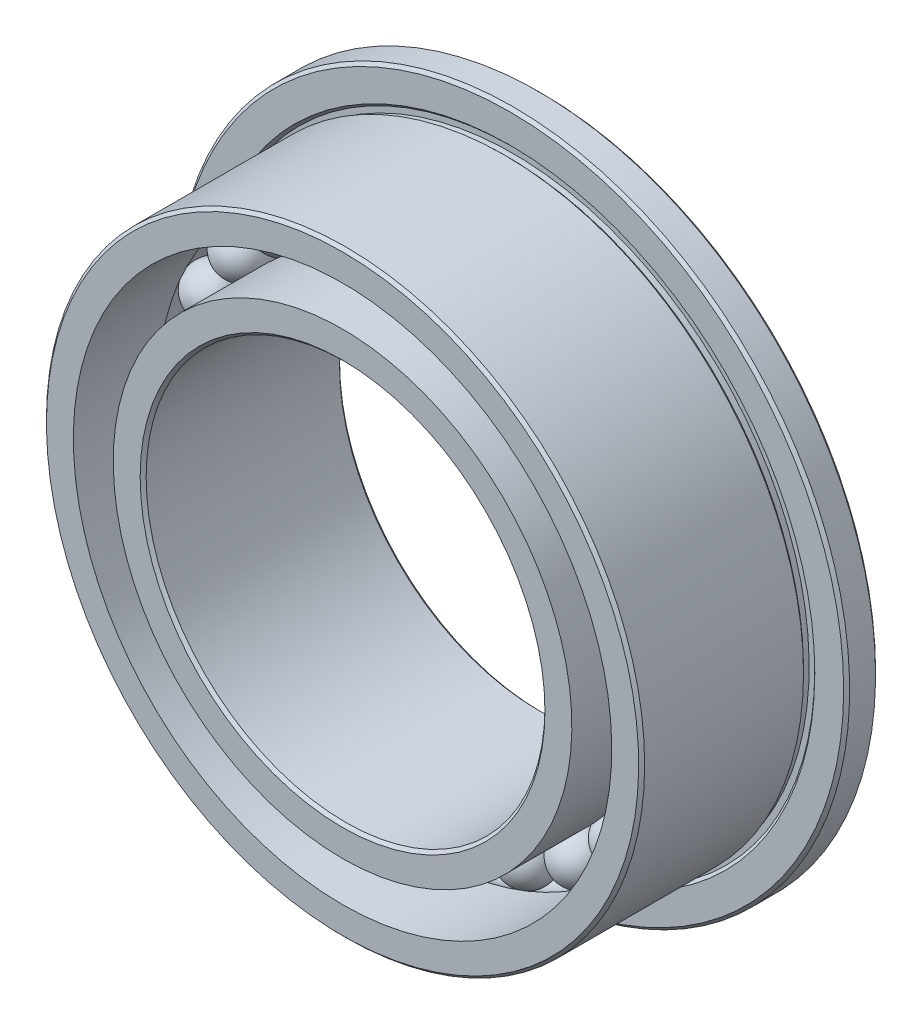
ISO-10303-21;
HEADER;
FILE_DESCRIPTION(('STEP AP214'),'2;1');
FILE_NAME('part.step','',(''),(''),'','','');
FILE_SCHEMA(('AUTOMOTIVE_DESIGN { 1 0 10303 214 1 1 1 1 }'));
ENDSEC;
DATA;
#1=APPLICATION_CONTEXT('core data for automotive mechanical design processes');
#2=APPLICATION_PROTOCOL_DEFINITION('international standard','automotive_design',2000,#1);
#3=PRODUCT_CONTEXT('',#1,'mechanical');
#4=PRODUCT('Part','Part','',(#3));
#5=PRODUCT_RELATED_PRODUCT_CATEGORY('part','',(#4));
#6=PRODUCT_DEFINITION_FORMATION('','',#4);
#7=PRODUCT_DEFINITION_CONTEXT('part definition',#1,'design');
#8=PRODUCT_DEFINITION('design','',#6,#7);
#9=PRODUCT_DEFINITION_SHAPE('','',#8);
#10=(LENGTH_UNIT() NAMED_UNIT(*) SI_UNIT(.MILLI.,.METRE.));
#11=(NAMED_UNIT(*) PLANE_ANGLE_UNIT() SI_UNIT($,.RADIAN.));
#12=(NAMED_UNIT(*) SI_UNIT($,.STERADIAN.) SOLID_ANGLE_UNIT());
#13=UNCERTAINTY_MEASURE_WITH_UNIT(LENGTH_MEASURE(1.E-05),#10,'distance_accuracy_value','');
#14=(GEOMETRIC_REPRESENTATION_CONTEXT(3) GLOBAL_UNCERTAINTY_ASSIGNED_CONTEXT((#13)) GLOBAL_UNIT_ASSIGNED_CONTEXT((#10,
#11,#12)) REPRESENTATION_CONTEXT('',''));
#15=CARTESIAN_POINT('',(0.,0.,0.));
#16=DIRECTION('',(0.,0.,1.));
#17=DIRECTION('',(1.,0.,0.));
#18=AXIS2_PLACEMENT_3D('',#15,#16,#17);
#19=CARTESIAN_POINT('',(-0.915256737009006,3.86177183011369,0.));
#20=DIRECTION('',(-0.230615870742427,0.973044870579827,0.));
#21=DIRECTION('',(0.973044870579827,0.230615870742427,0.));
#22=AXIS2_PLACEMENT_3D('',#19,#20,#21);
#23=SPHERICAL_SURFACE('',#22,0.396875);
#24=CARTESIAN_POINT('',(-1.00678241070991,4.24794901312506,0.));
#25=VERTEX_POINT('',#24);
#26=VERTEX_LOOP('',#25);
#27=FACE_BOUND('',#26,.T.);
#28=ADVANCED_FACE('F47',(#27),#23,.T.);
#29=CLOSED_SHELL('',(#28));
#30=MANIFOLD_SOLID_BREP('B2',#29);
#31=CARTESIAN_POINT('',(-1.78117174642054,3.54660454128357,0.));
#32=DIRECTION('',(-0.448799180200451,0.893632640323418,0.));
#33=DIRECTION('',(0.893632640323418,0.448799180200451,0.));
#34=AXIS2_PLACEMENT_3D('',#31,#32,#33);
#35=SPHERICAL_SURFACE('',#34,0.396875);
#36=CARTESIAN_POINT('',(-1.95928892106259,3.90126499541192,0.));
#37=VERTEX_POINT('',#36);
#38=VERTEX_LOOP('',#37);
#39=FACE_BOUND('',#38,.T.);
#40=ADVANCED_FACE('F65',(#39),#35,.T.);
#41=CLOSED_SHELL('',(#40));
#42=MANIFOLD_SOLID_BREP('B7',#41);
#43=CARTESIAN_POINT('',(-2.55106332594341,3.04023888362848,0.));
#44=DIRECTION('',(-0.642787609686529,0.766044443118986,0.));
#45=DIRECTION('',(0.766044443118986,0.642787609686529,0.));
#46=AXIS2_PLACEMENT_3D('',#43,#44,#45);
#47=SPHERICAL_SURFACE('',#46,0.396875);
#48=CARTESIAN_POINT('',(-2.80616965853775,3.34426277199133,0.));
#49=VERTEX_POINT('',#48);
#50=VERTEX_LOOP('',#49);
#51=FACE_BOUND('',#50,.T.);
#52=ADVANCED_FACE('F83',(#51),#47,.T.);
#53=CLOSED_SHELL('',(#52));
#54=MANIFOLD_SOLID_BREP('B43',#53);
#55=CARTESIAN_POINT('',(-3.18342642124655,2.36997316082047,0.));
#56=DIRECTION('',(-0.802123192755037,0.597158591702796,0.));
#57=DIRECTION('',(0.597158591702796,0.802123192755037,0.));
#58=AXIS2_PLACEMENT_3D('',#55,#56,#57);
#59=SPHERICAL_SURFACE('',#58,0.396875);
#60=CARTESIAN_POINT('',(-3.50176906337121,2.60697047690252,0.));
#61=VERTEX_POINT('',#60);
#62=VERTEX_LOOP('',#61);
#63=FACE_BOUND('',#62,.T.);
#64=ADVANCED_FACE('F101',(#63),#59,.T.);
#65=CLOSED_SHELL('',(#64));
#66=MANIFOLD_SOLID_BREP('B61',#65);
#67=CARTESIAN_POINT('',(-3.64417017418107,1.57194157146794,0.));
#68=DIRECTION('',(-0.91821610688027,0.396079766039167,0.));
#69=DIRECTION('',(0.396079766039167,0.91821610688027,0.));
#70=AXIS2_PLACEMENT_3D('',#67,#68,#69);
#71=SPHERICAL_SURFACE('',#70,0.396875);
#72=CARTESIAN_POINT('',(-4.00858719159918,1.72913572861474,0.));
#73=VERTEX_POINT('',#72);
#74=VERTEX_LOOP('',#73);
#75=FACE_BOUND('',#74,.T.);
#76=ADVANCED_FACE('F119',(#75),#71,.T.);
#77=CLOSED_SHELL('',(#76));
#78=MANIFOLD_SOLID_BREP('B79',#77);
#79=CARTESIAN_POINT('',(-3.90845576976719,0.689166205115674,0.));
#80=DIRECTION('',(-0.984807753012206,0.173648177666941,0.));
#81=DIRECTION('',(0.173648177666941,0.984807753012206,0.));
#82=AXIS2_PLACEMENT_3D('',#79,#80,#81);
#83=SPHERICAL_SURFACE('',#82,0.396875);
#84=CARTESIAN_POINT('',(-4.29930134674391,0.758082825627241,0.));
#85=VERTEX_POINT('',#84);
#86=VERTEX_LOOP('',#85);
#87=FACE_BOUND('',#86,.T.);
#88=ADVANCED_FACE('F137',(#87),#83,.T.);
#89=CLOSED_SHELL('',(#88));
#90=MANIFOLD_SOLID_BREP('B97',#89);
#91=CARTESIAN_POINT('',(-3.9620355031391,-0.23076228973841,0.));
#92=DIRECTION('',(-0.998308158271269,-0.0581448289104657,0.));
#93=DIRECTION('',(-0.0581448289104657,0.998308158271269,0.));
#94=AXIS2_PLACEMENT_3D('',#91,#92,#93);
#95=SPHERICAL_SURFACE('',#94,0.396875);
#96=CARTESIAN_POINT('',(-4.35823905345301,-0.253838518712251,0.));
#97=VERTEX_POINT('',#96);
#98=VERTEX_LOOP('',#97);
#99=FACE_BOUND('',#98,.T.);
#100=ADVANCED_FACE('F155',(#99),#95,.T.);
#101=CLOSED_SHELL('',(#100));
#102=MANIFOLD_SOLID_BREP('B115',#101);
#103=CARTESIAN_POINT('',(-3.80202087700211,-1.1382503298221,0.));
#104=DIRECTION('',(-0.957989512315492,-0.286803232711081,0.));
#105=DIRECTION('',(-0.286803232711081,0.957989512315492,0.));
#106=AXIS2_PLACEMENT_3D('',#103,#104,#105);
#107=SPHERICAL_SURFACE('',#106,0.396875);
#108=CARTESIAN_POINT('',(-4.18222296470232,-1.25207536280431,0.));
#109=VERTEX_POINT('',#108);
#110=VERTEX_LOOP('',#109);
#111=FACE_BOUND('',#110,.T.);
#112=ADVANCED_FACE('F173',(#111),#107,.T.);
#113=CLOSED_SHELL('',(#112));
#114=MANIFOLD_SOLID_BREP('B133',#113);
#115=CARTESIAN_POINT('',(-3.43703832126951,-1.98437499999997,0.));
#116=DIRECTION('',(-0.866025403784443,-0.499999999999992,0.));
#117=DIRECTION('',(-0.499999999999992,0.866025403784443,0.));
#118=AXIS2_PLACEMENT_3D('',#115,#116,#117);
#119=SPHERICAL_SURFACE('',#118,0.396875);
#120=CARTESIAN_POINT('',(-3.78074215339646,-2.18281249999996,0.));
#121=VERTEX_POINT('',#120);
#122=VERTEX_LOOP('',#121);
#123=FACE_BOUND('',#122,.T.);
#124=ADVANCED_FACE('F191',(#123),#119,.T.);
#125=CLOSED_SHELL('',(#124));
#126=MANIFOLD_SOLID_BREP('B151',#125);
#127=CARTESIAN_POINT('',(-2.88676413999306,-2.72352150029151,0.));
#128=DIRECTION('',(-0.727373641573055,-0.686241637868727,0.));
#129=DIRECTION('',(-0.686241637868727,0.727373641573055,0.));
#130=AXIS2_PLACEMENT_3D('',#127,#128,#129);
#131=SPHERICAL_SURFACE('',#130,0.396875);
#132=CARTESIAN_POINT('',(-3.17544055399237,-2.99587365032066,0.));
#133=VERTEX_POINT('',#132);
#134=VERTEX_LOOP('',#133);
#135=FACE_BOUND('',#134,.T.);
#136=ADVANCED_FACE('F209',(#135),#131,.T.);
#137=CLOSED_SHELL('',(#136));
#138=MANIFOLD_SOLID_BREP('B169',#137);
#139=CARTESIAN_POINT('',(-2.18086375671854,-3.31584225154507,0.));
#140=DIRECTION('',(-0.549508978070813,-0.835487811412932,0.));
#141=DIRECTION('',(-0.835487811412932,0.549508978070813,0.));
#142=AXIS2_PLACEMENT_3D('',#139,#140,#141);
#143=SPHERICAL_SURFACE('',#142,0.396875);
#144=CARTESIAN_POINT('',(-2.39895013239039,-3.64742647669958,0.));
#145=VERTEX_POINT('',#144);
#146=VERTEX_LOOP('',#145);
#147=FACE_BOUND('',#146,.T.);
#148=ADVANCED_FACE('F227',(#147),#143,.T.);
#149=CLOSED_SHELL('',(#148));
#150=MANIFOLD_SOLID_BREP('B187',#149);
#151=CARTESIAN_POINT('',(-1.35739244382378,-3.72940508874406,0.));
#152=DIRECTION('',(-0.342020143325676,-0.939692620785906,0.));
#153=DIRECTION('',(-0.939692620785906,0.342020143325676,0.));
#154=AXIS2_PLACEMENT_3D('',#151,#152,#153);
#155=SPHERICAL_SURFACE('',#154,0.396875);
#156=CARTESIAN_POINT('',(-1.49313168820615,-4.10234559761847,0.));
#157=VERTEX_POINT('',#156);
#158=VERTEX_LOOP('',#157);
#159=FACE_BOUND('',#158,.T.);
#160=ADVANCED_FACE('F245',(#159),#155,.T.);
#161=CLOSED_SHELL('',(#160));
#162=MANIFOLD_SOLID_BREP('B205',#161);
#163=CARTESIAN_POINT('',(-0.460743752934537,-3.94191473228833,0.));
#164=DIRECTION('',(-0.116092914125238,-0.993238357741942,0.));
#165=DIRECTION('',(-0.993238357741942,0.116092914125238,0.));
#166=AXIS2_PLACEMENT_3D('',#163,#164,#165);
#167=SPHERICAL_SURFACE('',#166,0.396875);
#168=CARTESIAN_POINT('',(-0.50681812822799,-4.33610620551717,0.));
#169=VERTEX_POINT('',#168);
#170=VERTEX_LOOP('',#169);
#171=FACE_BOUND('',#170,.T.);
#172=ADVANCED_FACE('F263',(#171),#167,.T.);
#173=CLOSED_SHELL('',(#172));
#174=MANIFOLD_SOLID_BREP('B223',#173);
#175=CARTESIAN_POINT('',(0.46074375293448,-3.94191473228834,0.));
#176=DIRECTION('',(0.116092914125223,-0.993238357741944,0.));
#177=DIRECTION('',(-0.993238357741944,-0.116092914125223,0.));
#178=AXIS2_PLACEMENT_3D('',#175,#176,#177);
#179=SPHERICAL_SURFACE('',#178,0.396875);
#180=CARTESIAN_POINT('',(0.506818128227928,-4.33610620551717,0.));
#181=VERTEX_POINT('',#180);
#182=VERTEX_LOOP('',#181);
#183=FACE_BOUND('',#182,.T.);
#184=ADVANCED_FACE('F281',(#183),#179,.T.);
#185=CLOSED_SHELL('',(#184));
#186=MANIFOLD_SOLID_BREP('B241',#185);
#187=CARTESIAN_POINT('',(1.35739244382372,-3.72940508874408,0.));
#188=DIRECTION('',(0.342020143325663,-0.939692620785911,0.));
#189=DIRECTION('',(-0.939692620785911,-0.342020143325663,0.));
#190=AXIS2_PLACEMENT_3D('',#187,#188,#189);
#191=SPHERICAL_SURFACE('',#190,0.396875);
#192=CARTESIAN_POINT('',(1.4931316882061,-4.10234559761849,0.));
#193=VERTEX_POINT('',#192);
#194=VERTEX_LOOP('',#193);
#195=FACE_BOUND('',#194,.T.);
#196=ADVANCED_FACE('F299',(#195),#191,.T.);
#197=CLOSED_SHELL('',(#196));
#198=MANIFOLD_SOLID_BREP('B259',#197);
#199=CARTESIAN_POINT('',(2.18086375671849,-3.3158422515451,0.));
#200=DIRECTION('',(0.549508978070801,-0.835487811412939,0.));
#201=DIRECTION('',(-0.835487811412939,-0.549508978070801,0.));
#202=AXIS2_PLACEMENT_3D('',#199,#200,#201);
#203=SPHERICAL_SURFACE('',#202,0.396875);
#204=CARTESIAN_POINT('',(2.39895013239034,-3.64742647669961,0.));
#205=VERTEX_POINT('',#204);
#206=VERTEX_LOOP('',#205);
#207=FACE_BOUND('',#206,.T.);
#208=ADVANCED_FACE('F317',(#207),#203,.T.);
#209=CLOSED_SHELL('',(#208));
#210=MANIFOLD_SOLID_BREP('B277',#209);
#211=CARTESIAN_POINT('',(2.88676413999302,-2.72352150029155,0.));
#212=DIRECTION('',(0.727373641573045,-0.686241637868737,0.));
#213=DIRECTION('',(-0.686241637868737,-0.727373641573045,0.));
#214=AXIS2_PLACEMENT_3D('',#211,#212,#213);
#215=SPHERICAL_SURFACE('',#214,0.396875);
#216=CARTESIAN_POINT('',(3.17544055399233,-2.99587365032071,0.));
#217=VERTEX_POINT('',#216);
#218=VERTEX_LOOP('',#217);
#219=FACE_BOUND('',#218,.T.);
#220=ADVANCED_FACE('F335',(#219),#215,.T.);
#221=CLOSED_SHELL('',(#220));
#222=MANIFOLD_SOLID_BREP('B295',#221);
#223=CARTESIAN_POINT('',(3.43703832126948,-1.98437500000002,0.));
#224=DIRECTION('',(0.866025403784437,-0.500000000000004,0.));
#225=DIRECTION('',(-0.500000000000004,-0.866025403784437,0.));
#226=AXIS2_PLACEMENT_3D('',#223,#224,#225);
#227=SPHERICAL_SURFACE('',#226,0.396875);
#228=CARTESIAN_POINT('',(3.78074215339643,-2.18281250000002,0.));
#229=VERTEX_POINT('',#228);
#230=VERTEX_LOOP('',#229);
#231=FACE_BOUND('',#230,.T.);
#232=ADVANCED_FACE('F353',(#231),#227,.T.);
#233=CLOSED_SHELL('',(#232));
#234=MANIFOLD_SOLID_BREP('B313',#233);
#235=CARTESIAN_POINT('',(3.80202087700209,-1.13825032982216,0.));
#236=DIRECTION('',(0.957989512315488,-0.286803232711094,0.));
#237=DIRECTION('',(-0.286803232711094,-0.957989512315488,0.));
#238=AXIS2_PLACEMENT_3D('',#235,#236,#237);
#239=SPHERICAL_SURFACE('',#238,0.396875);
#240=CARTESIAN_POINT('',(4.1822229647023,-1.25207536280437,0.));
#241=VERTEX_POINT('',#240);
#242=VERTEX_LOOP('',#241);
#243=FACE_BOUND('',#242,.T.);
#244=ADVANCED_FACE('F371',(#243),#239,.T.);
#245=CLOSED_SHELL('',(#244));
#246=MANIFOLD_SOLID_BREP('B331',#245);
#247=CARTESIAN_POINT('',(3.9620355031391,-0.230762289738466,0.));
#248=DIRECTION('',(0.998308158271268,-0.0581448289104794,0.));
#249=DIRECTION('',(-0.0581448289104794,-0.998308158271268,0.));
#250=AXIS2_PLACEMENT_3D('',#247,#248,#249);
#251=SPHERICAL_SURFACE('',#250,0.396875);
#252=CARTESIAN_POINT('',(4.358239053453,-0.253838518712312,0.));
#253=VERTEX_POINT('',#252);
#254=VERTEX_LOOP('',#253);
#255=FACE_BOUND('',#254,.T.);
#256=ADVANCED_FACE('F389',(#255),#251,.T.);
#257=CLOSED_SHELL('',(#256));
#258=MANIFOLD_SOLID_BREP('B349',#257);
#259=CARTESIAN_POINT('',(3.9084557697672,0.689166205115617,0.));
#260=DIRECTION('',(0.984807753012209,0.173648177666927,0.));
#261=DIRECTION('',(0.173648177666927,-0.984807753012209,0.));
#262=AXIS2_PLACEMENT_3D('',#259,#260,#261);
#263=SPHERICAL_SURFACE('',#262,0.396875);
#264=CARTESIAN_POINT('',(4.29930134674392,0.758082825627179,0.));
#265=VERTEX_POINT('',#264);
#266=VERTEX_LOOP('',#265);
#267=FACE_BOUND('',#266,.T.);
#268=ADVANCED_FACE('F407',(#267),#263,.T.);
#269=CLOSED_SHELL('',(#268));
#270=MANIFOLD_SOLID_BREP('B367',#269);
#271=CARTESIAN_POINT('',(3.64417017418109,1.57194157146789,0.));
#272=DIRECTION('',(0.918216106880275,0.396079766039155,0.));
#273=DIRECTION('',(0.396079766039155,-0.918216106880275,0.));
#274=AXIS2_PLACEMENT_3D('',#271,#272,#273);
#275=SPHERICAL_SURFACE('',#274,0.396875);
#276=CARTESIAN_POINT('',(4.0085871915992,1.72913572861468,0.));
#277=VERTEX_POINT('',#276);
#278=VERTEX_LOOP('',#277);
#279=FACE_BOUND('',#278,.T.);
#280=ADVANCED_FACE('F425',(#279),#275,.T.);
#281=CLOSED_SHELL('',(#280));
#282=MANIFOLD_SOLID_BREP('B385',#281);
#283=CARTESIAN_POINT('',(3.18342642124659,2.36997316082043,0.));
#284=DIRECTION('',(0.802123192755045,0.597158591702785,0.));
#285=DIRECTION('',(0.597158591702785,-0.802123192755045,0.));
#286=AXIS2_PLACEMENT_3D('',#283,#284,#285);
#287=SPHERICAL_SURFACE('',#286,0.396875);
#288=CARTESIAN_POINT('',(3.50176906337124,2.60697047690247,0.));
#289=VERTEX_POINT('',#288);
#290=VERTEX_LOOP('',#289);
#291=FACE_BOUND('',#290,.T.);
#292=ADVANCED_FACE('F443',(#291),#287,.T.);
#293=CLOSED_SHELL('',(#292));
#294=MANIFOLD_SOLID_BREP('B403',#293);
#295=CARTESIAN_POINT('',(2.55106332594346,3.04023888362844,0.));
#296=DIRECTION('',(0.64278760968654,0.766044443118977,0.));
#297=DIRECTION('',(0.766044443118977,-0.64278760968654,0.));
#298=AXIS2_PLACEMENT_3D('',#295,#296,#297);
#299=SPHERICAL_SURFACE('',#298,0.396875);
#300=CARTESIAN_POINT('',(2.8061696585378,3.34426277199128,0.));
#301=VERTEX_POINT('',#300);
#302=VERTEX_LOOP('',#301);
#303=FACE_BOUND('',#302,.T.);
#304=ADVANCED_FACE('F461',(#303),#299,.T.);
#305=CLOSED_SHELL('',(#304));
#306=MANIFOLD_SOLID_BREP('B421',#305);
#307=CARTESIAN_POINT('',(1.78117174642059,3.54660454128354,0.));
#308=DIRECTION('',(0.448799180200463,0.893632640323412,0.));
#309=DIRECTION('',(0.893632640323412,-0.448799180200463,0.));
#310=AXIS2_PLACEMENT_3D('',#307,#308,#309);
#311=SPHERICAL_SURFACE('',#310,0.396875);
#312=CARTESIAN_POINT('',(1.95928892106265,3.90126499541189,0.));
#313=VERTEX_POINT('',#312);
#314=VERTEX_LOOP('',#313);
#315=FACE_BOUND('',#314,.T.);
#316=ADVANCED_FACE('F479',(#315),#311,.T.);
#317=CLOSED_SHELL('',(#316));
#318=MANIFOLD_SOLID_BREP('B439',#317);
#319=CARTESIAN_POINT('',(0.915256737009062,3.86177183011368,0.));
#320=DIRECTION('',(0.230615870742441,0.973044870579824,0.));
#321=DIRECTION('',(0.973044870579824,-0.230615870742441,0.));
#322=AXIS2_PLACEMENT_3D('',#319,#320,#321);
#323=SPHERICAL_SURFACE('',#322,0.396875);
#324=CARTESIAN_POINT('',(1.00678241070997,4.24794901312504,0.));
#325=VERTEX_POINT('',#324);
#326=VERTEX_LOOP('',#325);
#327=FACE_BOUND('',#326,.T.);
#328=ADVANCED_FACE('F497',(#327),#323,.T.);
#329=CLOSED_SHELL('',(#328));
#330=MANIFOLD_SOLID_BREP('B457',#329);
#331=CARTESIAN_POINT('',(0.,3.96875,0.));
#332=DIRECTION('',(0.,1.,0.));
#333=DIRECTION('',(1.,0.,0.));
#334=AXIS2_PLACEMENT_3D('',#331,#332,#333);
#335=SPHERICAL_SURFACE('',#334,0.396875);
#336=CARTESIAN_POINT('',(0.,4.365625,0.));
#337=VERTEX_POINT('',#336);
#338=VERTEX_LOOP('',#337);
#339=FACE_BOUND('',#338,.T.);
#340=ADVANCED_FACE('F518',(#339),#335,.T.);
#341=CLOSED_SHELL('',(#340));
#342=MANIFOLD_SOLID_BREP('B475',#341);
#343=CARTESIAN_POINT('',(0.,0.,0.));
#344=DIRECTION('',(0.,0.,1.));
#345=DIRECTION('',(0.,-1.,0.));
#346=AXIS2_PLACEMENT_3D('',#343,#344,#345);
#347=CYLINDRICAL_SURFACE('',#346,3.65125);
#348=CARTESIAN_POINT('',(0.,0.,-0.238125));
#349=DIRECTION('',(0.,0.,1.));
#350=DIRECTION('',(0.,-1.,0.));
#351=AXIS2_PLACEMENT_3D('',#348,#349,#350);
#352=CIRCLE('',#351,3.65125);
#353=CARTESIAN_POINT('',(0.,-3.65125,-0.238125));
#354=VERTEX_POINT('',#353);
#355=EDGE_CURVE('E559',#354,#354,#352,.T.);
#356=ORIENTED_EDGE('',*,*,#355,.F.);
#357=EDGE_LOOP('',(#356));
#358=FACE_BOUND('',#357,.T.);
#359=CARTESIAN_POINT('',(0.,0.,-1.5875));
#360=DIRECTION('',(0.,0.,1.));
#361=DIRECTION('',(0.,-1.,0.));
#362=AXIS2_PLACEMENT_3D('',#359,#360,#361);
#363=CIRCLE('',#362,3.65125);
#364=CARTESIAN_POINT('',(0.,-3.65125,-1.5875));
#365=VERTEX_POINT('',#364);
#366=EDGE_CURVE('E568',#365,#365,#363,.T.);
#367=ORIENTED_EDGE('',*,*,#366,.T.);
#368=EDGE_LOOP('',(#367));
#369=FACE_BOUND('',#368,.T.);
#370=ADVANCED_FACE('F539',(#358,#369),#347,.T.);
#371=CARTESIAN_POINT('',(0.,0.,0.));
#372=DIRECTION('',(0.,0.,1.));
#373=DIRECTION('',(0.,-1.,0.));
#374=AXIS2_PLACEMENT_3D('',#371,#372,#373);
#375=TOROIDAL_SURFACE('',#374,3.96875,0.396875);
#376=CARTESIAN_POINT('',(0.,0.,0.238125));
#377=DIRECTION('',(0.,0.,1.));
#378=DIRECTION('',(0.,-1.,0.));
#379=AXIS2_PLACEMENT_3D('',#376,#377,#378);
#380=CIRCLE('',#379,3.65125);
#381=CARTESIAN_POINT('',(0.,-3.65125,0.238124999999999));
#382=VERTEX_POINT('',#381);
#383=EDGE_CURVE('E562',#382,#382,#380,.T.);
#384=ORIENTED_EDGE('',*,*,#383,.F.);
#385=EDGE_LOOP('',(#384));
#386=FACE_BOUND('',#385,.T.);
#387=ORIENTED_EDGE('',*,*,#355,.T.);
#388=EDGE_LOOP('',(#387));
#389=FACE_BOUND('',#388,.T.);
#390=ADVANCED_FACE('F587',(#386,#389),#375,.F.);
#391=CARTESIAN_POINT('',(0.,0.,0.));
#392=DIRECTION('',(0.,0.,1.));
#393=DIRECTION('',(0.,-1.,0.));
#394=AXIS2_PLACEMENT_3D('',#391,#392,#393);
#395=CYLINDRICAL_SURFACE('',#394,3.65125);
#396=CARTESIAN_POINT('',(0.,0.,1.5875));
#397=DIRECTION('',(0.,0.,1.));
#398=DIRECTION('',(0.,-1.,0.));
#399=AXIS2_PLACEMENT_3D('',#396,#397,#398);
#400=CIRCLE('',#399,3.65125);
#401=CARTESIAN_POINT('',(0.,-3.65125,1.5875));
#402=VERTEX_POINT('',#401);
#403=EDGE_CURVE('E565',#402,#402,#400,.T.);
#404=ORIENTED_EDGE('',*,*,#403,.F.);
#405=EDGE_LOOP('',(#404));
#406=FACE_BOUND('',#405,.T.);
#407=ORIENTED_EDGE('',*,*,#383,.T.);
#408=EDGE_LOOP('',(#407));
#409=FACE_BOUND('',#408,.T.);
#410=ADVANCED_FACE('F593',(#406,#409),#395,.T.);
#411=CARTESIAN_POINT('',(0.,3.175,1.5875));
#412=DIRECTION('',(0.,0.,-1.));
#413=DIRECTION('',(0.,1.,0.));
#414=AXIS2_PLACEMENT_3D('',#411,#412,#413);
#415=PLANE('',#414);
#416=CARTESIAN_POINT('',(0.,0.,1.5875));
#417=DIRECTION('',(0.,0.,-1.));
#418=DIRECTION('',(0.,1.,0.));
#419=AXIS2_PLACEMENT_3D('',#416,#417,#418);
#420=CIRCLE('',#419,3.222625);
#421=CARTESIAN_POINT('',(0.,3.222625,1.5875));
#422=VERTEX_POINT('',#421);
#423=EDGE_CURVE('E517',#422,#422,#420,.T.);
#424=ORIENTED_EDGE('',*,*,#423,.T.);
#425=EDGE_LOOP('',(#424));
#426=FACE_BOUND('',#425,.T.);
#427=ORIENTED_EDGE('',*,*,#403,.T.);
#428=EDGE_LOOP('',(#427));
#429=FACE_BOUND('',#428,.T.);
#430=ADVANCED_FACE('F584',(#426,#429),#415,.F.);
#431=CARTESIAN_POINT('',(0.,0.,0.));
#432=DIRECTION('',(0.,0.,1.));
#433=DIRECTION('',(0.,-1.,0.));
#434=AXIS2_PLACEMENT_3D('',#431,#432,#433);
#435=CYLINDRICAL_SURFACE('',#434,3.175);
#436=CARTESIAN_POINT('',(0.,0.,-1.539875));
#437=DIRECTION('',(0.,0.,1.));
#438=DIRECTION('',(0.,-1.,0.));
#439=AXIS2_PLACEMENT_3D('',#436,#437,#438);
#440=CIRCLE('',#439,3.175);
#441=CARTESIAN_POINT('',(0.,-3.175,-1.539875));
#442=VERTEX_POINT('',#441);
#443=EDGE_CURVE('E546',#442,#442,#440,.F.);
#444=ORIENTED_EDGE('',*,*,#443,.T.);
#445=EDGE_LOOP('',(#444));
#446=FACE_BOUND('',#445,.T.);
#447=CARTESIAN_POINT('',(0.,0.,1.539875));
#448=DIRECTION('',(0.,0.,-1.));
#449=DIRECTION('',(0.,1.,0.));
#450=AXIS2_PLACEMENT_3D('',#447,#448,#449);
#451=CIRCLE('',#450,3.175);
#452=CARTESIAN_POINT('',(0.,3.175,1.539875));
#453=VERTEX_POINT('',#452);
#454=EDGE_CURVE('E550',#453,#453,#451,.F.);
#455=ORIENTED_EDGE('',*,*,#454,.T.);
#456=EDGE_LOOP('',(#455));
#457=FACE_BOUND('',#456,.T.);
#458=ADVANCED_FACE('F576',(#446,#457),#435,.F.);
#459=CARTESIAN_POINT('',(0.,3.65125,-1.5875));
#460=DIRECTION('',(0.,0.,1.));
#461=DIRECTION('',(0.,-1.,0.));
#462=AXIS2_PLACEMENT_3D('',#459,#460,#461);
#463=PLANE('',#462);
#464=CARTESIAN_POINT('',(0.,0.,-1.5875));
#465=DIRECTION('',(0.,0.,1.));
#466=DIRECTION('',(0.,-1.,0.));
#467=AXIS2_PLACEMENT_3D('',#464,#465,#466);
#468=CIRCLE('',#467,3.222625);
#469=CARTESIAN_POINT('',(0.,-3.222625,-1.5875));
#470=VERTEX_POINT('',#469);
#471=EDGE_CURVE('E554',#470,#470,#468,.T.);
#472=ORIENTED_EDGE('',*,*,#471,.T.);
#473=EDGE_LOOP('',(#472));
#474=FACE_BOUND('',#473,.T.);
#475=ORIENTED_EDGE('',*,*,#366,.F.);
#476=EDGE_LOOP('',(#475));
#477=FACE_BOUND('',#476,.T.);
#478=ADVANCED_FACE('F573',(#474,#477),#463,.F.);
#479=CARTESIAN_POINT('',(0.,0.,-1.5875));
#480=DIRECTION('',(0.,0.,-1.));
#481=DIRECTION('',(0.,1.,0.));
#482=AXIS2_PLACEMENT_3D('',#479,#480,#481);
#483=CONICAL_SURFACE('',#482,3.222625,0.785398163397448);
#484=ORIENTED_EDGE('',*,*,#443,.F.);
#485=EDGE_LOOP('',(#484));
#486=FACE_BOUND('',#485,.T.);
#487=ORIENTED_EDGE('',*,*,#471,.F.);
#488=EDGE_LOOP('',(#487));
#489=FACE_BOUND('',#488,.T.);
#490=ADVANCED_FACE('F575',(#486,#489),#483,.F.);
#491=CARTESIAN_POINT('',(0.,0.,1.539875));
#492=DIRECTION('',(0.,0.,1.));
#493=DIRECTION('',(0.,-1.,0.));
#494=AXIS2_PLACEMENT_3D('',#491,#492,#493);
#495=CONICAL_SURFACE('',#494,3.175,0.785398163397448);
#496=ORIENTED_EDGE('',*,*,#423,.F.);
#497=EDGE_LOOP('',(#496));
#498=FACE_BOUND('',#497,.T.);
#499=ORIENTED_EDGE('',*,*,#454,.F.);
#500=EDGE_LOOP('',(#499));
#501=FACE_BOUND('',#500,.T.);
#502=ADVANCED_FACE('F541',(#498,#501),#495,.F.);
#503=CLOSED_SHELL('',(#370,#390,#410,#430,#458,#478,#490,#502));
#504=MANIFOLD_SOLID_BREP('B493',#503);
#505=CARTESIAN_POINT('',(0.,4.28625,-1.5875));
#506=DIRECTION('',(0.,0.,1.));
#507=DIRECTION('',(0.,-1.,0.));
#508=AXIS2_PLACEMENT_3D('',#505,#506,#507);
#509=PLANE('',#508);
#510=CARTESIAN_POINT('',(0.,0.,-1.5875));
#511=DIRECTION('',(0.,0.,1.));
#512=DIRECTION('',(0.,-1.,0.));
#513=AXIS2_PLACEMENT_3D('',#510,#511,#512);
#514=CIRCLE('',#513,5.311775);
#515=CARTESIAN_POINT('',(0.,-5.311775,-1.5875));
#516=VERTEX_POINT('',#515);
#517=EDGE_CURVE('E679',#516,#516,#514,.F.);
#518=ORIENTED_EDGE('',*,*,#517,.T.);
#519=EDGE_LOOP('',(#518));
#520=FACE_BOUND('',#519,.T.);
#521=CARTESIAN_POINT('',(0.,0.,-1.5875));
#522=DIRECTION('',(0.,0.,1.));
#523=DIRECTION('',(0.,-1.,0.));
#524=AXIS2_PLACEMENT_3D('',#521,#522,#523);
#525=CIRCLE('',#524,4.28625);
#526=CARTESIAN_POINT('',(0.,-4.28625,-1.5875));
#527=VERTEX_POINT('',#526);
#528=EDGE_CURVE('E693',#527,#527,#525,.T.);
#529=ORIENTED_EDGE('',*,*,#528,.T.);
#530=EDGE_LOOP('',(#529));
#531=FACE_BOUND('',#530,.T.);
#532=ADVANCED_FACE('F661',(#520,#531),#509,.F.);
#533=CARTESIAN_POINT('',(0.,0.,0.));
#534=DIRECTION('',(0.,0.,1.));
#535=DIRECTION('',(0.,-1.,0.));
#536=AXIS2_PLACEMENT_3D('',#533,#534,#535);
#537=CYLINDRICAL_SURFACE('',#536,4.28625);
#538=ORIENTED_EDGE('',*,*,#528,.F.);
#539=EDGE_LOOP('',(#538));
#540=FACE_BOUND('',#539,.T.);
#541=CARTESIAN_POINT('',(0.,0.,-0.238125));
#542=DIRECTION('',(0.,0.,1.));
#543=DIRECTION('',(0.,-1.,0.));
#544=AXIS2_PLACEMENT_3D('',#541,#542,#543);
#545=CIRCLE('',#544,4.28625);
#546=CARTESIAN_POINT('',(0.,-4.28625,-0.238125));
#547=VERTEX_POINT('',#546);
#548=EDGE_CURVE('E697',#547,#547,#545,.T.);
#549=ORIENTED_EDGE('',*,*,#548,.T.);
#550=EDGE_LOOP('',(#549));
#551=FACE_BOUND('',#550,.T.);
#552=ADVANCED_FACE('F748',(#540,#551),#537,.F.);
#553=CARTESIAN_POINT('',(0.,0.,0.));
#554=DIRECTION('',(0.,0.,1.));
#555=DIRECTION('',(0.,-1.,0.));
#556=AXIS2_PLACEMENT_3D('',#553,#554,#555);
#557=TOROIDAL_SURFACE('',#556,3.96875,0.396875);
#558=ORIENTED_EDGE('',*,*,#548,.F.);
#559=EDGE_LOOP('',(#558));
#560=FACE_BOUND('',#559,.T.);
#561=CARTESIAN_POINT('',(0.,0.,0.238125));
#562=DIRECTION('',(0.,0.,1.));
#563=DIRECTION('',(0.,-1.,0.));
#564=AXIS2_PLACEMENT_3D('',#561,#562,#563);
#565=CIRCLE('',#564,4.28625);
#566=CARTESIAN_POINT('',(0.,-4.28625,0.238124999999999));
#567=VERTEX_POINT('',#566);
#568=EDGE_CURVE('E701',#567,#567,#565,.T.);
#569=ORIENTED_EDGE('',*,*,#568,.T.);
#570=EDGE_LOOP('',(#569));
#571=FACE_BOUND('',#570,.T.);
#572=ADVANCED_FACE('F754',(#560,#571),#557,.F.);
#573=CARTESIAN_POINT('',(0.,0.,0.));
#574=DIRECTION('',(0.,0.,1.));
#575=DIRECTION('',(0.,-1.,0.));
#576=AXIS2_PLACEMENT_3D('',#573,#574,#575);
#577=CYLINDRICAL_SURFACE('',#576,4.28625);
#578=ORIENTED_EDGE('',*,*,#568,.F.);
#579=EDGE_LOOP('',(#578));
#580=FACE_BOUND('',#579,.T.);
#581=CARTESIAN_POINT('',(0.,0.,1.5875));
#582=DIRECTION('',(0.,0.,1.));
#583=DIRECTION('',(0.,-1.,0.));
#584=AXIS2_PLACEMENT_3D('',#581,#582,#583);
#585=CIRCLE('',#584,4.28625);
#586=CARTESIAN_POINT('',(0.,-4.28625,1.5875));
#587=VERTEX_POINT('',#586);
#588=EDGE_CURVE('E705',#587,#587,#585,.T.);
#589=ORIENTED_EDGE('',*,*,#588,.T.);
#590=EDGE_LOOP('',(#589));
#591=FACE_BOUND('',#590,.T.);
#592=ADVANCED_FACE('F818',(#580,#591),#577,.F.);
#593=CARTESIAN_POINT('',(0.,4.7625,1.5875));
#594=DIRECTION('',(0.,0.,-1.));
#595=DIRECTION('',(0.,1.,0.));
#596=AXIS2_PLACEMENT_3D('',#593,#594,#595);
#597=PLANE('',#596);
#598=CARTESIAN_POINT('',(0.,0.,1.5875));
#599=DIRECTION('',(0.,0.,-1.));
#600=DIRECTION('',(0.,1.,0.));
#601=AXIS2_PLACEMENT_3D('',#598,#599,#600);
#602=CIRCLE('',#601,4.714875);
#603=CARTESIAN_POINT('',(0.,4.714875,1.5875));
#604=VERTEX_POINT('',#603);
#605=EDGE_CURVE('E669',#604,#604,#602,.F.);
#606=ORIENTED_EDGE('',*,*,#605,.T.);
#607=EDGE_LOOP('',(#606));
#608=FACE_BOUND('',#607,.T.);
#609=ORIENTED_EDGE('',*,*,#588,.F.);
#610=EDGE_LOOP('',(#609));
#611=FACE_BOUND('',#610,.T.);
#612=ADVANCED_FACE('F808',(#608,#611),#597,.F.);
#613=CARTESIAN_POINT('',(0.,0.,0.));
#614=DIRECTION('',(0.,0.,1.));
#615=DIRECTION('',(0.,-1.,0.));
#616=AXIS2_PLACEMENT_3D('',#613,#614,#615);
#617=CYLINDRICAL_SURFACE('',#616,4.7625);
#618=CARTESIAN_POINT('',(0.,0.,1.539875));
#619=DIRECTION('',(0.,0.,-1.));
#620=DIRECTION('',(0.,1.,0.));
#621=AXIS2_PLACEMENT_3D('',#618,#619,#620);
#622=CIRCLE('',#621,4.7625);
#623=CARTESIAN_POINT('',(0.,4.7625,1.539875));
#624=VERTEX_POINT('',#623);
#625=EDGE_CURVE('E538',#624,#624,#622,.T.);
#626=ORIENTED_EDGE('',*,*,#625,.T.);
#627=EDGE_LOOP('',(#626));
#628=FACE_BOUND('',#627,.T.);
#629=CARTESIAN_POINT('',(0.,0.,-0.989697438789311));
#630=DIRECTION('',(0.,0.,1.));
#631=DIRECTION('',(0.,-1.,0.));
#632=AXIS2_PLACEMENT_3D('',#629,#630,#631);
#633=CIRCLE('',#632,4.7625);
#634=CARTESIAN_POINT('',(0.,-4.7625,-0.989697438789311));
#635=VERTEX_POINT('',#634);
#636=EDGE_CURVE('E709',#635,#635,#633,.T.);
#637=ORIENTED_EDGE('',*,*,#636,.T.);
#638=EDGE_LOOP('',(#637));
#639=FACE_BOUND('',#638,.T.);
#640=ADVANCED_FACE('F802',(#628,#639),#617,.T.);
#641=CARTESIAN_POINT('',(0.,0.,-1.03459871939466));
#642=DIRECTION('',(0.,0.,1.));
#643=DIRECTION('',(0.,-1.,0.));
#644=AXIS2_PLACEMENT_3D('',#641,#642,#643);
#645=CONICAL_SURFACE('',#644,4.71759871939465,0.785398163397458);
#646=ORIENTED_EDGE('',*,*,#636,.F.);
#647=EDGE_LOOP('',(#646));
#648=FACE_BOUND('',#647,.T.);
#649=CARTESIAN_POINT('',(0.,0.,-1.03459871939466));
#650=DIRECTION('',(0.,0.,1.));
#651=DIRECTION('',(0.,-1.,0.));
#652=AXIS2_PLACEMENT_3D('',#649,#650,#651);
#653=CIRCLE('',#652,4.71759871939465);
#654=CARTESIAN_POINT('',(0.,-4.71759871939465,-1.03459871939466));
#655=VERTEX_POINT('',#654);
#656=EDGE_CURVE('E713',#655,#655,#653,.T.);
#657=ORIENTED_EDGE('',*,*,#656,.T.);
#658=EDGE_LOOP('',(#657));
#659=FACE_BOUND('',#658,.T.);
#660=ADVANCED_FACE('F807',(#648,#659),#645,.T.);
#661=CARTESIAN_POINT('',(0.,0.,0.));
#662=DIRECTION('',(0.,0.,1.));
#663=DIRECTION('',(0.,-1.,0.));
#664=AXIS2_PLACEMENT_3D('',#661,#662,#663);
#665=CYLINDRICAL_SURFACE('',#664,4.71759871939465);
#666=ORIENTED_EDGE('',*,*,#656,.F.);
#667=EDGE_LOOP('',(#666));
#668=FACE_BOUND('',#667,.T.);
#669=CARTESIAN_POINT('',(0.,0.,-1.12440128060535));
#670=DIRECTION('',(0.,0.,1.));
#671=DIRECTION('',(0.,-1.,0.));
#672=AXIS2_PLACEMENT_3D('',#669,#670,#671);
#673=CIRCLE('',#672,4.71759871939466);
#674=CARTESIAN_POINT('',(0.,-4.71759871939466,-1.12440128060535));
#675=VERTEX_POINT('',#674);
#676=EDGE_CURVE('E717',#675,#675,#673,.T.);
#677=ORIENTED_EDGE('',*,*,#676,.T.);
#678=EDGE_LOOP('',(#677));
#679=FACE_BOUND('',#678,.T.);
#680=ADVANCED_FACE('F840',(#668,#679),#665,.T.);
#681=CARTESIAN_POINT('',(0.,4.80740128060535,-1.12440128060535));
#682=DIRECTION('',(0.,0.,-1.));
#683=DIRECTION('',(0.,1.,0.));
#684=AXIS2_PLACEMENT_3D('',#681,#682,#683);
#685=PLANE('',#684);
#686=ORIENTED_EDGE('',*,*,#676,.F.);
#687=EDGE_LOOP('',(#686));
#688=FACE_BOUND('',#687,.T.);
#689=CARTESIAN_POINT('',(0.,0.,-1.12440128060535));
#690=DIRECTION('',(0.,0.,1.));
#691=DIRECTION('',(0.,-1.,0.));
#692=AXIS2_PLACEMENT_3D('',#689,#690,#691);
#693=CIRCLE('',#692,4.80740128060535);
#694=CARTESIAN_POINT('',(0.,-4.80740128060535,-1.12440128060535));
#695=VERTEX_POINT('',#694);
#696=EDGE_CURVE('E721',#695,#695,#693,.T.);
#697=ORIENTED_EDGE('',*,*,#696,.T.);
#698=EDGE_LOOP('',(#697));
#699=FACE_BOUND('',#698,.T.);
#700=ADVANCED_FACE('F744',(#688,#699),#685,.F.);
#701=CARTESIAN_POINT('',(0.,0.,-1.0795));
#702=DIRECTION('',(0.,0.,1.));
#703=DIRECTION('',(0.,-1.,0.));
#704=AXIS2_PLACEMENT_3D('',#701,#702,#703);
#705=CONICAL_SURFACE('',#704,4.85230256121069,0.785398163397444);
#706=ORIENTED_EDGE('',*,*,#696,.F.);
#707=EDGE_LOOP('',(#706));
#708=FACE_BOUND('',#707,.T.);
#709=CARTESIAN_POINT('',(0.,0.,-1.0795));
#710=DIRECTION('',(0.,0.,1.));
#711=DIRECTION('',(0.,-1.,0.));
#712=AXIS2_PLACEMENT_3D('',#709,#710,#711);
#713=CIRCLE('',#712,4.85230256121069);
#714=CARTESIAN_POINT('',(0.,-4.85230256121069,-1.0795));
#715=VERTEX_POINT('',#714);
#716=EDGE_CURVE('E725',#715,#715,#713,.T.);
#717=ORIENTED_EDGE('',*,*,#716,.T.);
#718=EDGE_LOOP('',(#717));
#719=FACE_BOUND('',#718,.T.);
#720=ADVANCED_FACE('F730',(#708,#719),#705,.F.);
#721=CARTESIAN_POINT('',(0.,5.3594,-1.0795));
#722=DIRECTION('',(0.,0.,-1.));
#723=DIRECTION('',(0.,1.,0.));
#724=AXIS2_PLACEMENT_3D('',#721,#722,#723);
#725=PLANE('',#724);
#726=CARTESIAN_POINT('',(0.,0.,-1.0795));
#727=DIRECTION('',(0.,0.,-1.));
#728=DIRECTION('',(0.,1.,0.));
#729=AXIS2_PLACEMENT_3D('',#726,#727,#728);
#730=CIRCLE('',#729,5.311775);
#731=CARTESIAN_POINT('',(0.,5.311775,-1.0795));
#732=VERTEX_POINT('',#731);
#733=EDGE_CURVE('E674',#732,#732,#730,.F.);
#734=ORIENTED_EDGE('',*,*,#733,.T.);
#735=EDGE_LOOP('',(#734));
#736=FACE_BOUND('',#735,.T.);
#737=ORIENTED_EDGE('',*,*,#716,.F.);
#738=EDGE_LOOP('',(#737));
#739=FACE_BOUND('',#738,.T.);
#740=ADVANCED_FACE('F732',(#736,#739),#725,.F.);
#741=CARTESIAN_POINT('',(0.,0.,0.));
#742=DIRECTION('',(0.,0.,1.));
#743=DIRECTION('',(0.,-1.,0.));
#744=AXIS2_PLACEMENT_3D('',#741,#742,#743);
#745=CYLINDRICAL_SURFACE('',#744,5.3594);
#746=CARTESIAN_POINT('',(0.,0.,-1.539875));
#747=DIRECTION('',(0.,0.,1.));
#748=DIRECTION('',(0.,-1.,0.));
#749=AXIS2_PLACEMENT_3D('',#746,#747,#748);
#750=CIRCLE('',#749,5.3594);
#751=CARTESIAN_POINT('',(0.,-5.3594,-1.539875));
#752=VERTEX_POINT('',#751);
#753=EDGE_CURVE('E685',#752,#752,#750,.T.);
#754=ORIENTED_EDGE('',*,*,#753,.T.);
#755=EDGE_LOOP('',(#754));
#756=FACE_BOUND('',#755,.T.);
#757=CARTESIAN_POINT('',(0.,0.,-1.127125));
#758=DIRECTION('',(0.,0.,-1.));
#759=DIRECTION('',(0.,1.,0.));
#760=AXIS2_PLACEMENT_3D('',#757,#758,#759);
#761=CIRCLE('',#760,5.3594);
#762=CARTESIAN_POINT('',(0.,5.3594,-1.127125));
#763=VERTEX_POINT('',#762);
#764=EDGE_CURVE('E689',#763,#763,#761,.T.);
#765=ORIENTED_EDGE('',*,*,#764,.T.);
#766=EDGE_LOOP('',(#765));
#767=FACE_BOUND('',#766,.T.);
#768=ADVANCED_FACE('F734',(#756,#767),#745,.T.);
#769=CARTESIAN_POINT('',(0.,0.,-1.539875));
#770=DIRECTION('',(0.,0.,1.));
#771=DIRECTION('',(0.,-1.,0.));
#772=AXIS2_PLACEMENT_3D('',#769,#770,#771);
#773=CONICAL_SURFACE('',#772,5.3594,0.785398163397448);
#774=ORIENTED_EDGE('',*,*,#517,.F.);
#775=EDGE_LOOP('',(#774));
#776=FACE_BOUND('',#775,.T.);
#777=ORIENTED_EDGE('',*,*,#753,.F.);
#778=EDGE_LOOP('',(#777));
#779=FACE_BOUND('',#778,.T.);
#780=ADVANCED_FACE('F741',(#776,#779),#773,.T.);
#781=CARTESIAN_POINT('',(0.,0.,-1.0795));
#782=DIRECTION('',(0.,0.,-1.));
#783=DIRECTION('',(0.,1.,0.));
#784=AXIS2_PLACEMENT_3D('',#781,#782,#783);
#785=CONICAL_SURFACE('',#784,5.311775,0.785398163397448);
#786=ORIENTED_EDGE('',*,*,#764,.F.);
#787=EDGE_LOOP('',(#786));
#788=FACE_BOUND('',#787,.T.);
#789=ORIENTED_EDGE('',*,*,#733,.F.);
#790=EDGE_LOOP('',(#789));
#791=FACE_BOUND('',#790,.T.);
#792=ADVANCED_FACE('F761',(#788,#791),#785,.T.);
#793=CARTESIAN_POINT('',(0.,0.,1.5875));
#794=DIRECTION('',(0.,0.,-1.));
#795=DIRECTION('',(0.,1.,0.));
#796=AXIS2_PLACEMENT_3D('',#793,#794,#795);
#797=CONICAL_SURFACE('',#796,4.714875,0.785398163397448);
#798=ORIENTED_EDGE('',*,*,#625,.F.);
#799=EDGE_LOOP('',(#798));
#800=FACE_BOUND('',#799,.T.);
#801=ORIENTED_EDGE('',*,*,#605,.F.);
#802=EDGE_LOOP('',(#801));
#803=FACE_BOUND('',#802,.T.);
#804=ADVANCED_FACE('F663',(#800,#803),#797,.T.);
#805=CLOSED_SHELL('',(#532,#552,#572,#592,#612,#640,#660,#680,#700,#720,#740,#768,#780,#792,#804));
#806=MANIFOLD_SOLID_BREP('B512',#805);
#807=ADVANCED_BREP_SHAPE_REPRESENTATION('',(#18,#30,#42,#54,#66,#78,#90,#102,#114,#126,#138,
#150,#162,#174,#186,#198,#210,#222,#234,#246,#258,#270,#282,#294,#306,#318,#330,#342,#504,#806),#14);
#808=SHAPE_DEFINITION_REPRESENTATION(#9,#807);
ENDSEC;
END-ISO-10303-21;
